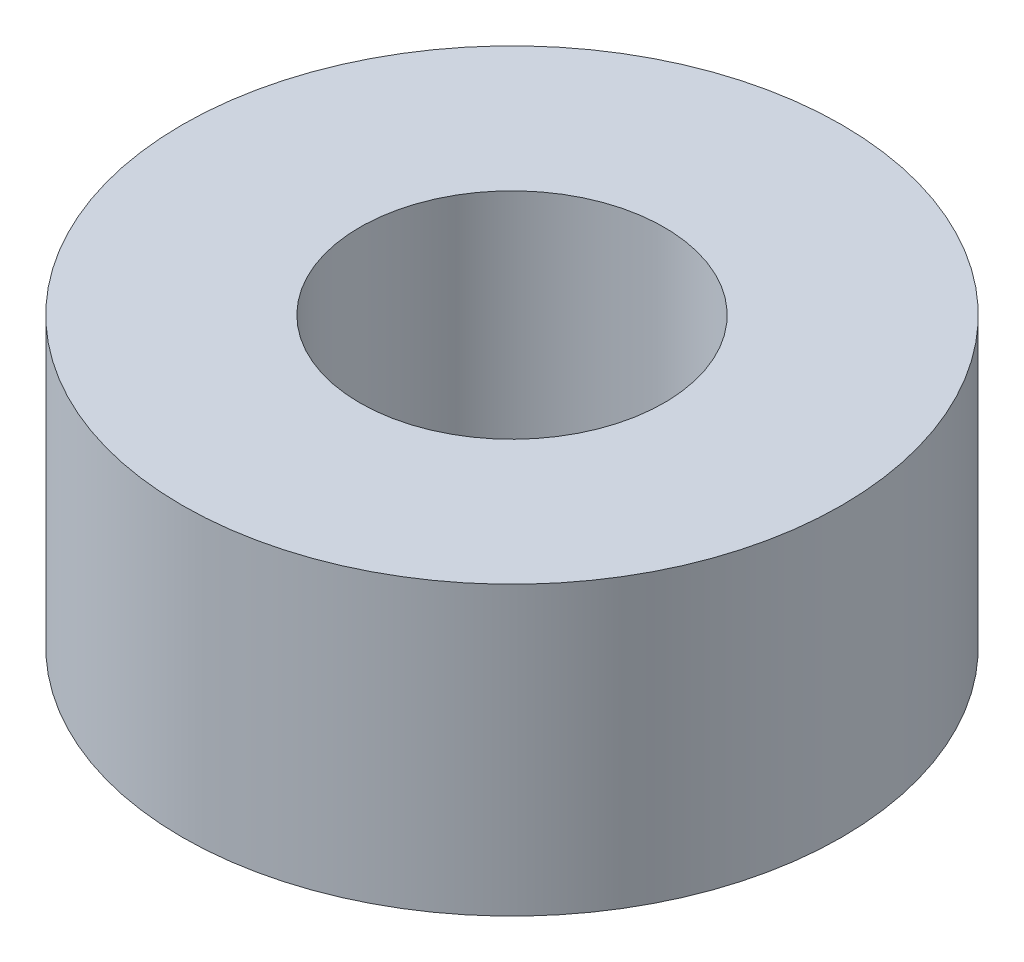
ISO-10303-21;
HEADER;
FILE_DESCRIPTION(('STEP AP214'),'2;1');
FILE_NAME('part.step','',(''),(''),'','','');
FILE_SCHEMA(('AUTOMOTIVE_DESIGN { 1 0 10303 214 1 1 1 1 }'));
ENDSEC;
DATA;
#1=APPLICATION_CONTEXT('core data for automotive mechanical design processes');
#2=APPLICATION_PROTOCOL_DEFINITION('international standard','automotive_design',2000,#1);
#3=PRODUCT_CONTEXT('',#1,'mechanical');
#4=PRODUCT('Part','Part','',(#3));
#5=PRODUCT_RELATED_PRODUCT_CATEGORY('part','',(#4));
#6=PRODUCT_DEFINITION_FORMATION('','',#4);
#7=PRODUCT_DEFINITION_CONTEXT('part definition',#1,'design');
#8=PRODUCT_DEFINITION('design','',#6,#7);
#9=PRODUCT_DEFINITION_SHAPE('','',#8);
#10=(LENGTH_UNIT() NAMED_UNIT(*) SI_UNIT(.MILLI.,.METRE.));
#11=(NAMED_UNIT(*) PLANE_ANGLE_UNIT() SI_UNIT($,.RADIAN.));
#12=(NAMED_UNIT(*) SI_UNIT($,.STERADIAN.) SOLID_ANGLE_UNIT());
#13=UNCERTAINTY_MEASURE_WITH_UNIT(LENGTH_MEASURE(1.E-05),#10,'distance_accuracy_value','');
#14=(GEOMETRIC_REPRESENTATION_CONTEXT(3) GLOBAL_UNCERTAINTY_ASSIGNED_CONTEXT((#13)) GLOBAL_UNIT_ASSIGNED_CONTEXT((#10,
#11,#12)) REPRESENTATION_CONTEXT('',''));
#15=CARTESIAN_POINT('',(0.,0.,0.));
#16=DIRECTION('',(0.,0.,1.));
#17=DIRECTION('',(1.,0.,0.));
#18=AXIS2_PLACEMENT_3D('',#15,#16,#17);
#19=CARTESIAN_POINT('',(0.,1.7,0.));
#20=DIRECTION('',(0.,1.,0.));
#21=DIRECTION('',(0.,0.,1.));
#22=AXIS2_PLACEMENT_3D('',#19,#20,#21);
#23=PLANE('',#22);
#24=CARTESIAN_POINT('',(0.,1.7,0.));
#25=DIRECTION('',(0.,1.,0.));
#26=DIRECTION('',(0.,0.,1.));
#27=AXIS2_PLACEMENT_3D('',#24,#25,#26);
#28=CIRCLE('',#27,1.95);
#29=CARTESIAN_POINT('',(0.,1.7,1.95));
#30=VERTEX_POINT('',#29);
#31=EDGE_CURVE('E10',#30,#30,#28,.T.);
#32=ORIENTED_EDGE('',*,*,#31,.T.);
#33=EDGE_LOOP('',(#32));
#34=FACE_BOUND('',#33,.T.);
#35=CARTESIAN_POINT('',(0.,1.7,0.));
#36=DIRECTION('',(0.,1.,0.));
#37=DIRECTION('',(0.,0.,1.));
#38=AXIS2_PLACEMENT_3D('',#35,#36,#37);
#39=CIRCLE('',#38,0.9);
#40=CARTESIAN_POINT('',(0.,1.7,0.9));
#41=VERTEX_POINT('',#40);
#42=EDGE_CURVE('E47',#41,#41,#39,.T.);
#43=ORIENTED_EDGE('',*,*,#42,.F.);
#44=EDGE_LOOP('',(#43));
#45=FACE_BOUND('',#44,.T.);
#46=ADVANCED_FACE('F36',(#34,#45),#23,.T.);
#47=CARTESIAN_POINT('',(0.,0.,0.));
#48=DIRECTION('',(0.,1.,0.));
#49=DIRECTION('',(0.,0.,1.));
#50=AXIS2_PLACEMENT_3D('',#47,#48,#49);
#51=PLANE('',#50);
#52=CARTESIAN_POINT('',(0.,0.,0.));
#53=DIRECTION('',(0.,1.,0.));
#54=DIRECTION('',(0.,0.,1.));
#55=AXIS2_PLACEMENT_3D('',#52,#53,#54);
#56=CIRCLE('',#55,1.95);
#57=CARTESIAN_POINT('',(0.,0.,1.95));
#58=VERTEX_POINT('',#57);
#59=EDGE_CURVE('E40',#58,#58,#56,.T.);
#60=ORIENTED_EDGE('',*,*,#59,.F.);
#61=EDGE_LOOP('',(#60));
#62=FACE_BOUND('',#61,.T.);
#63=CARTESIAN_POINT('',(0.,0.,0.));
#64=DIRECTION('',(0.,1.,0.));
#65=DIRECTION('',(0.,0.,1.));
#66=AXIS2_PLACEMENT_3D('',#63,#64,#65);
#67=CIRCLE('',#66,0.9);
#68=CARTESIAN_POINT('',(0.,0.,0.9));
#69=VERTEX_POINT('',#68);
#70=EDGE_CURVE('E49',#69,#69,#67,.T.);
#71=ORIENTED_EDGE('',*,*,#70,.T.);
#72=EDGE_LOOP('',(#71));
#73=FACE_BOUND('',#72,.T.);
#74=ADVANCED_FACE('F59',(#62,#73),#51,.F.);
#75=CARTESIAN_POINT('',(0.,1.7,0.));
#76=DIRECTION('',(0.,-1.,0.));
#77=DIRECTION('',(0.,0.,-1.));
#78=AXIS2_PLACEMENT_3D('',#75,#76,#77);
#79=CYLINDRICAL_SURFACE('',#78,1.95);
#80=ORIENTED_EDGE('',*,*,#31,.F.);
#81=EDGE_LOOP('',(#80));
#82=FACE_BOUND('',#81,.T.);
#83=ORIENTED_EDGE('',*,*,#59,.T.);
#84=EDGE_LOOP('',(#83));
#85=FACE_BOUND('',#84,.T.);
#86=ADVANCED_FACE('F38',(#82,#85),#79,.T.);
#87=CARTESIAN_POINT('',(0.,1.7,0.));
#88=DIRECTION('',(0.,-1.,0.));
#89=DIRECTION('',(0.,0.,-1.));
#90=AXIS2_PLACEMENT_3D('',#87,#88,#89);
#91=CYLINDRICAL_SURFACE('',#90,0.9);
#92=ORIENTED_EDGE('',*,*,#42,.T.);
#93=EDGE_LOOP('',(#92));
#94=FACE_BOUND('',#93,.T.);
#95=ORIENTED_EDGE('',*,*,#70,.F.);
#96=EDGE_LOOP('',(#95));
#97=FACE_BOUND('',#96,.T.);
#98=ADVANCED_FACE('F55',(#94,#97),#91,.F.);
#99=CLOSED_SHELL('',(#46,#74,#86,#98));
#100=MANIFOLD_SOLID_BREP('B2',#99);
#101=ADVANCED_BREP_SHAPE_REPRESENTATION('',(#18,#100),#14);
#102=SHAPE_DEFINITION_REPRESENTATION(#9,#101);
ENDSEC;
END-ISO-10303-21;
